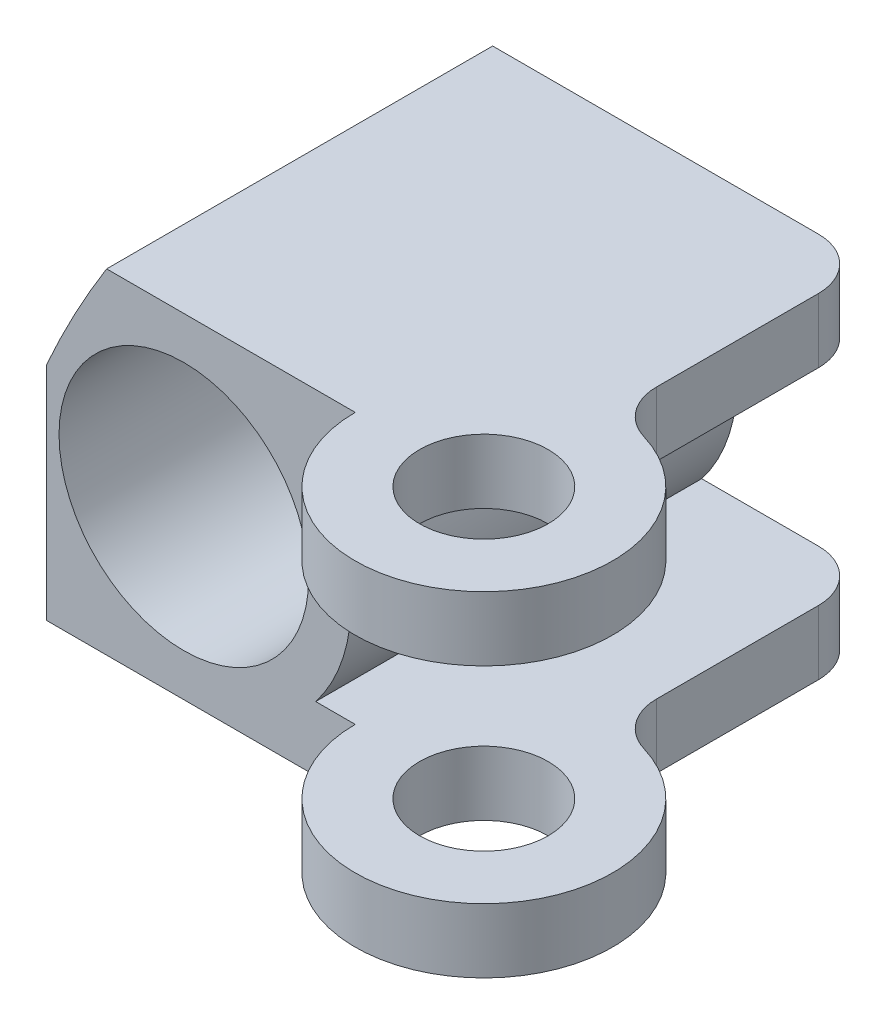
ISO-10303-21;
HEADER;
FILE_DESCRIPTION(('STEP AP214'),'2;1');
FILE_NAME('part.step','',(''),(''),'','','');
FILE_SCHEMA(('AUTOMOTIVE_DESIGN { 1 0 10303 214 1 1 1 1 }'));
ENDSEC;
DATA;
#1=APPLICATION_CONTEXT('core data for automotive mechanical design processes');
#2=APPLICATION_PROTOCOL_DEFINITION('international standard','automotive_design',2000,#1);
#3=PRODUCT_CONTEXT('',#1,'mechanical');
#4=PRODUCT('Part','Part','',(#3));
#5=PRODUCT_RELATED_PRODUCT_CATEGORY('part','',(#4));
#6=PRODUCT_DEFINITION_FORMATION('','',#4);
#7=PRODUCT_DEFINITION_CONTEXT('part definition',#1,'design');
#8=PRODUCT_DEFINITION('design','',#6,#7);
#9=PRODUCT_DEFINITION_SHAPE('','',#8);
#10=(LENGTH_UNIT() NAMED_UNIT(*) SI_UNIT(.MILLI.,.METRE.));
#11=(NAMED_UNIT(*) PLANE_ANGLE_UNIT() SI_UNIT($,.RADIAN.));
#12=(NAMED_UNIT(*) SI_UNIT($,.STERADIAN.) SOLID_ANGLE_UNIT());
#13=UNCERTAINTY_MEASURE_WITH_UNIT(LENGTH_MEASURE(1.E-05),#10,'distance_accuracy_value','');
#14=(GEOMETRIC_REPRESENTATION_CONTEXT(3) GLOBAL_UNCERTAINTY_ASSIGNED_CONTEXT((#13)) GLOBAL_UNIT_ASSIGNED_CONTEXT((#10,
#11,#12)) REPRESENTATION_CONTEXT('',''));
#15=CARTESIAN_POINT('',(0.,0.,0.));
#16=DIRECTION('',(0.,0.,1.));
#17=DIRECTION('',(1.,0.,0.));
#18=AXIS2_PLACEMENT_3D('',#15,#16,#17);
#19=CARTESIAN_POINT('',(-33.8574358250765,15.3458200795581,-25.4));
#20=DIRECTION('',(0.,0.,-1.));
#21=DIRECTION('',(1.,0.,0.));
#22=AXIS2_PLACEMENT_3D('',#19,#20,#21);
#23=PLANE('',#22);
#24=DIRECTION('',(1.,0.,0.));
#25=VECTOR('',#24,1.);
#26=CARTESIAN_POINT('',(-43.8807790564313,7.09082007955806,-25.4));
#27=LINE('',#26,#25);
#28=CARTESIAN_POINT('',(-43.8807790564313,7.09082007955806,-25.4));
#29=VERTEX_POINT('',#28);
#30=CARTESIAN_POINT('',(-21.59,7.09082007955806,-25.4));
#31=VERTEX_POINT('',#30);
#32=EDGE_CURVE('E342',#29,#31,#27,.T.);
#33=ORIENTED_EDGE('',*,*,#32,.F.);
#34=CARTESIAN_POINT('',(0.,0.,-25.4));
#35=DIRECTION('',(0.,0.,1.));
#36=DIRECTION('',(-1.,0.,0.));
#37=AXIS2_PLACEMENT_3D('',#34,#35,#36);
#38=CIRCLE('',#37,44.45);
#39=CARTESIAN_POINT('',(-37.6670119809407,23.6008200795581,-25.4));
#40=VERTEX_POINT('',#39);
#41=EDGE_CURVE('E339',#40,#29,#38,.T.);
#42=ORIENTED_EDGE('',*,*,#41,.F.);
#43=DIRECTION('',(-1.,0.,0.));
#44=VECTOR('',#43,1.);
#45=CARTESIAN_POINT('',(-37.6670119809407,23.6008200795581,-25.4));
#46=LINE('',#45,#44);
#47=CARTESIAN_POINT('',(-21.59,23.6008200795581,-25.4));
#48=VERTEX_POINT('',#47);
#49=EDGE_CURVE('E334',#48,#40,#46,.T.);
#50=ORIENTED_EDGE('',*,*,#49,.F.);
#51=DIRECTION('',(0.,1.,0.));
#52=VECTOR('',#51,1.);
#53=CARTESIAN_POINT('',(-21.59,23.6008200795581,-25.4));
#54=LINE('',#53,#52);
#55=CARTESIAN_POINT('',(-21.59,20.4258200795581,-25.4));
#56=VERTEX_POINT('',#55);
#57=EDGE_CURVE('E306',#56,#48,#54,.T.);
#58=ORIENTED_EDGE('',*,*,#57,.F.);
#59=DIRECTION('',(1.,0.,0.));
#60=VECTOR('',#59,1.);
#61=CARTESIAN_POINT('',(-27.3506220886921,20.4258200795581,-25.4));
#62=LINE('',#61,#60);
#63=CARTESIAN_POINT('',(-27.3506220886921,20.4258200795581,-25.4));
#64=VERTEX_POINT('',#63);
#65=EDGE_CURVE('E331',#64,#56,#62,.T.);
#66=ORIENTED_EDGE('',*,*,#65,.F.);
#67=CARTESIAN_POINT('',(-33.8574358250765,15.3458200795581,-25.4));
#68=DIRECTION('',(0.,0.,1.));
#69=DIRECTION('',(1.,0.,0.));
#70=AXIS2_PLACEMENT_3D('',#67,#68,#69);
#71=CIRCLE('',#70,8.255);
#72=CARTESIAN_POINT('',(-27.3506220886921,10.2658200795581,-25.4));
#73=VERTEX_POINT('',#72);
#74=EDGE_CURVE('E335',#73,#64,#71,.T.);
#75=ORIENTED_EDGE('',*,*,#74,.F.);
#76=DIRECTION('',(-1.,0.,0.));
#77=VECTOR('',#76,1.);
#78=CARTESIAN_POINT('',(-27.3506220886921,10.2658200795581,-25.4));
#79=LINE('',#78,#77);
#80=CARTESIAN_POINT('',(-21.59,10.2658200795581,-25.4));
#81=VERTEX_POINT('',#80);
#82=EDGE_CURVE('E263',#81,#73,#79,.T.);
#83=ORIENTED_EDGE('',*,*,#82,.F.);
#84=DIRECTION('',(0.,1.,0.));
#85=VECTOR('',#84,1.);
#86=CARTESIAN_POINT('',(-21.59,10.2658200795581,-25.4));
#87=LINE('',#86,#85);
#88=EDGE_CURVE('E309',#31,#81,#87,.T.);
#89=ORIENTED_EDGE('',*,*,#88,.F.);
#90=EDGE_LOOP('',(#33,#42,#50,#58,#66,#75,#83,#89));
#91=FACE_BOUND('',#90,.T.);
#92=CARTESIAN_POINT('',(-33.8574358250765,15.3458200795581,-25.4));
#93=DIRECTION('',(0.,0.,1.));
#94=DIRECTION('',(1.,0.,0.));
#95=AXIS2_PLACEMENT_3D('',#92,#93,#94);
#96=CIRCLE('',#95,6.1595);
#97=CARTESIAN_POINT('',(-27.6979358250765,15.3458200795581,-25.4));
#98=VERTEX_POINT('',#97);
#99=EDGE_CURVE('E354',#98,#98,#96,.T.);
#100=ORIENTED_EDGE('',*,*,#99,.T.);
#101=EDGE_LOOP('',(#100));
#102=FACE_BOUND('',#101,.T.);
#103=ADVANCED_FACE('F35',(#91,#102),#23,.T.);
#104=CARTESIAN_POINT('',(-33.8574358250765,15.3458200795581,-25.4));
#105=DIRECTION('',(0.,0.,1.));
#106=DIRECTION('',(-1.,0.,0.));
#107=AXIS2_PLACEMENT_3D('',#104,#105,#106);
#108=CYLINDRICAL_SURFACE('',#107,8.255);
#109=DIRECTION('',(0.,0.,1.));
#110=VECTOR('',#109,1.);
#111=CARTESIAN_POINT('',(-27.3506220886921,10.2658200795581,-25.4));
#112=LINE('',#111,#110);
#113=CARTESIAN_POINT('',(-27.3506220886921,10.2658200795581,-6.35));
#114=VERTEX_POINT('',#113);
#115=EDGE_CURVE('E349',#73,#114,#112,.T.);
#116=ORIENTED_EDGE('',*,*,#115,.F.);
#117=ORIENTED_EDGE('',*,*,#74,.T.);
#118=DIRECTION('',(0.,0.,1.));
#119=VECTOR('',#118,1.);
#120=CARTESIAN_POINT('',(-27.3506220886921,20.4258200795581,-25.4));
#121=LINE('',#120,#119);
#122=CARTESIAN_POINT('',(-27.3506220886921,20.4258200795581,-6.35));
#123=VERTEX_POINT('',#122);
#124=EDGE_CURVE('E276',#64,#123,#121,.T.);
#125=ORIENTED_EDGE('',*,*,#124,.T.);
#126=CARTESIAN_POINT('',(-33.8574358250765,15.3458200795581,-6.35));
#127=DIRECTION('',(0.,0.,1.));
#128=DIRECTION('',(1.,0.,0.));
#129=AXIS2_PLACEMENT_3D('',#126,#127,#128);
#130=CIRCLE('',#129,8.255);
#131=EDGE_CURVE('E184',#114,#123,#130,.T.);
#132=ORIENTED_EDGE('',*,*,#131,.F.);
#133=EDGE_LOOP('',(#116,#117,#125,#132));
#134=FACE_BOUND('',#133,.T.);
#135=ADVANCED_FACE('F222',(#134),#108,.T.);
#136=CARTESIAN_POINT('',(-27.3506220886921,20.4258200795581,-25.4));
#137=DIRECTION('',(0.,1.,0.));
#138=DIRECTION('',(0.,0.,-1.));
#139=AXIS2_PLACEMENT_3D('',#136,#137,#138);
#140=PLANE('',#139);
#141=DIRECTION('',(0.,0.,-1.));
#142=VECTOR('',#141,1.);
#143=CARTESIAN_POINT('',(-19.05,20.4258200795581,-25.4));
#144=LINE('',#143,#142);
#145=CARTESIAN_POINT('',(-19.05,20.4258200795581,-14.8694189942742));
#146=VERTEX_POINT('',#145);
#147=CARTESIAN_POINT('',(-19.05,20.4258200795581,-22.86));
#148=VERTEX_POINT('',#147);
#149=EDGE_CURVE('E194',#146,#148,#144,.T.);
#150=ORIENTED_EDGE('',*,*,#149,.F.);
#151=CARTESIAN_POINT('',(-16.51,20.4258200795581,-14.8694189942742));
#152=DIRECTION('',(0.,-1.,0.));
#153=DIRECTION('',(0.,0.,-1.));
#154=AXIS2_PLACEMENT_3D('',#151,#152,#153);
#155=CIRCLE('',#154,2.54);
#156=CARTESIAN_POINT('',(-17.2357142857143,20.4258200795581,-12.4352992816244));
#157=VERTEX_POINT('',#156);
#158=EDGE_CURVE('E297',#157,#146,#155,.T.);
#159=ORIENTED_EDGE('',*,*,#158,.F.);
#160=CARTESIAN_POINT('',(-19.05,20.4258200795581,-6.35));
#161=DIRECTION('',(0.,-1.,0.));
#162=DIRECTION('',(0.,0.,-1.));
#163=AXIS2_PLACEMENT_3D('',#160,#161,#162);
#164=CIRCLE('',#163,6.35);
#165=CARTESIAN_POINT('',(-25.4,20.4258200795581,-6.35));
#166=VERTEX_POINT('',#165);
#167=EDGE_CURVE('E191',#166,#157,#164,.F.);
#168=ORIENTED_EDGE('',*,*,#167,.F.);
#169=DIRECTION('',(1.,0.,0.));
#170=VECTOR('',#169,1.);
#171=CARTESIAN_POINT('',(-27.3506220886921,20.4258200795581,-6.35));
#172=LINE('',#171,#170);
#173=EDGE_CURVE('E187',#123,#166,#172,.T.);
#174=ORIENTED_EDGE('',*,*,#173,.F.);
#175=ORIENTED_EDGE('',*,*,#124,.F.);
#176=ORIENTED_EDGE('',*,*,#65,.T.);
#177=CARTESIAN_POINT('',(-21.59,20.4258200795581,-22.86));
#178=DIRECTION('',(0.,-1.,0.));
#179=DIRECTION('',(0.,0.,-1.));
#180=AXIS2_PLACEMENT_3D('',#177,#178,#179);
#181=CIRCLE('',#180,2.54);
#182=EDGE_CURVE('E11',#148,#56,#181,.F.);
#183=ORIENTED_EDGE('',*,*,#182,.F.);
#184=EDGE_LOOP('',(#150,#159,#168,#174,#175,#176,#183));
#185=FACE_BOUND('',#184,.T.);
#186=CARTESIAN_POINT('',(-19.05,20.4258200795581,-6.35));
#187=DIRECTION('',(0.,-1.,0.));
#188=DIRECTION('',(0.,0.,-1.));
#189=AXIS2_PLACEMENT_3D('',#186,#187,#188);
#190=CIRCLE('',#189,3.175);
#191=CARTESIAN_POINT('',(-19.05,20.4258200795581,-9.525));
#192=VERTEX_POINT('',#191);
#193=EDGE_CURVE('E272',#192,#192,#190,.T.);
#194=ORIENTED_EDGE('',*,*,#193,.F.);
#195=EDGE_LOOP('',(#194));
#196=FACE_BOUND('',#195,.T.);
#197=ADVANCED_FACE('F218',(#185,#196),#140,.F.);
#198=CARTESIAN_POINT('',(-37.6670119809407,23.6008200795581,-25.4));
#199=DIRECTION('',(0.,-1.,0.));
#200=DIRECTION('',(0.,0.,1.));
#201=AXIS2_PLACEMENT_3D('',#198,#199,#200);
#202=PLANE('',#201);
#203=ORIENTED_EDGE('',*,*,#49,.T.);
#204=DIRECTION('',(0.,0.,1.));
#205=VECTOR('',#204,1.);
#206=CARTESIAN_POINT('',(-37.6670119809407,23.6008200795581,-25.4));
#207=LINE('',#206,#205);
#208=CARTESIAN_POINT('',(-37.6670119809407,23.6008200795581,-6.35));
#209=VERTEX_POINT('',#208);
#210=EDGE_CURVE('E352',#40,#209,#207,.T.);
#211=ORIENTED_EDGE('',*,*,#210,.T.);
#212=DIRECTION('',(1.,0.,0.));
#213=VECTOR('',#212,1.);
#214=CARTESIAN_POINT('',(-40.64,23.6008200795581,-6.35));
#215=LINE('',#214,#213);
#216=CARTESIAN_POINT('',(-25.4,23.6008200795581,-6.35));
#217=VERTEX_POINT('',#216);
#218=EDGE_CURVE('E171',#209,#217,#215,.T.);
#219=ORIENTED_EDGE('',*,*,#218,.T.);
#220=CARTESIAN_POINT('',(-19.05,23.6008200795581,-6.35));
#221=DIRECTION('',(0.,1.,0.));
#222=DIRECTION('',(0.,0.,-1.));
#223=AXIS2_PLACEMENT_3D('',#220,#221,#222);
#224=CIRCLE('',#223,6.35);
#225=CARTESIAN_POINT('',(-17.2357142857143,23.6008200795581,-12.4352992816244));
#226=VERTEX_POINT('',#225);
#227=EDGE_CURVE('E174',#217,#226,#224,.T.);
#228=ORIENTED_EDGE('',*,*,#227,.T.);
#229=CARTESIAN_POINT('',(-16.51,23.6008200795581,-14.8694189942742));
#230=DIRECTION('',(0.,1.,0.));
#231=DIRECTION('',(0.,0.,1.));
#232=AXIS2_PLACEMENT_3D('',#229,#230,#231);
#233=CIRCLE('',#232,2.54);
#234=CARTESIAN_POINT('',(-19.05,23.6008200795581,-14.8694189942742));
#235=VERTEX_POINT('',#234);
#236=EDGE_CURVE('E294',#235,#226,#233,.T.);
#237=ORIENTED_EDGE('',*,*,#236,.F.);
#238=DIRECTION('',(0.,0.,-1.));
#239=VECTOR('',#238,1.);
#240=CARTESIAN_POINT('',(-19.05,23.6008200795581,-12.7));
#241=LINE('',#240,#239);
#242=CARTESIAN_POINT('',(-19.05,23.6008200795581,-22.86));
#243=VERTEX_POINT('',#242);
#244=EDGE_CURVE('E158',#235,#243,#241,.T.);
#245=ORIENTED_EDGE('',*,*,#244,.T.);
#246=CARTESIAN_POINT('',(-21.59,23.6008200795581,-22.86));
#247=DIRECTION('',(0.,1.,0.));
#248=DIRECTION('',(0.,0.,1.));
#249=AXIS2_PLACEMENT_3D('',#246,#247,#248);
#250=CIRCLE('',#249,2.54);
#251=EDGE_CURVE('E319',#48,#243,#250,.F.);
#252=ORIENTED_EDGE('',*,*,#251,.F.);
#253=EDGE_LOOP('',(#203,#211,#219,#228,#237,#245,#252));
#254=FACE_BOUND('',#253,.T.);
#255=CARTESIAN_POINT('',(-19.05,23.6008200795581,-6.35));
#256=DIRECTION('',(0.,-1.,0.));
#257=DIRECTION('',(0.,0.,-1.));
#258=AXIS2_PLACEMENT_3D('',#255,#256,#257);
#259=CIRCLE('',#258,3.175);
#260=CARTESIAN_POINT('',(-19.05,23.6008200795581,-9.525));
#261=VERTEX_POINT('',#260);
#262=EDGE_CURVE('E203',#261,#261,#259,.T.);
#263=ORIENTED_EDGE('',*,*,#262,.T.);
#264=EDGE_LOOP('',(#263));
#265=FACE_BOUND('',#264,.T.);
#266=ADVANCED_FACE('F213',(#254,#265),#202,.F.);
#267=CARTESIAN_POINT('',(0.,0.,-25.4));
#268=DIRECTION('',(0.,0.,1.));
#269=DIRECTION('',(-1.,0.,0.));
#270=AXIS2_PLACEMENT_3D('',#267,#268,#269);
#271=CYLINDRICAL_SURFACE('',#270,44.45);
#272=CARTESIAN_POINT('',(0.,0.,-6.35));
#273=DIRECTION('',(0.,0.,1.));
#274=DIRECTION('',(1.,0.,0.));
#275=AXIS2_PLACEMENT_3D('',#272,#273,#274);
#276=CIRCLE('',#275,44.45);
#277=CARTESIAN_POINT('',(-40.64,18.0053575360224,-6.35));
#278=VERTEX_POINT('',#277);
#279=EDGE_CURVE('E146',#209,#278,#276,.T.);
#280=ORIENTED_EDGE('',*,*,#279,.F.);
#281=ORIENTED_EDGE('',*,*,#210,.F.);
#282=ORIENTED_EDGE('',*,*,#41,.T.);
#283=DIRECTION('',(0.,0.,1.));
#284=VECTOR('',#283,1.);
#285=CARTESIAN_POINT('',(-43.8807790564313,7.09082007955806,-25.4));
#286=LINE('',#285,#284);
#287=CARTESIAN_POINT('',(-43.8807790564313,7.09082007955806,-11.8867179017965));
#288=VERTEX_POINT('',#287);
#289=EDGE_CURVE('E351',#29,#288,#286,.T.);
#290=ORIENTED_EDGE('',*,*,#289,.T.);
#291=CARTESIAN_POINT('',(-40.64,18.0053575360224,-6.35));
#292=CARTESIAN_POINT('',(-40.6399858684762,18.0053850674031,-6.42860205927988));
#293=CARTESIAN_POINT('',(-40.6414589667043,18.0020644090249,-6.50718713842052));
#294=CARTESIAN_POINT('',(-40.6472714524176,17.9889387291809,-6.6636382192536));
#295=CARTESIAN_POINT('',(-40.6516082538039,17.979139558198,-6.74150480551763));
#296=CARTESIAN_POINT('',(-40.6629877454723,17.953387179122,-6.89526719531025));
#297=CARTESIAN_POINT('',(-40.670005174567,17.9374914174421,-6.97117453940111));
#298=CARTESIAN_POINT('',(-40.6865585221489,17.8999128340143,-7.12125351985808));
#299=CARTESIAN_POINT('',(-40.6960948907276,17.8782289780255,-7.19542484344604));
#300=CARTESIAN_POINT('',(-40.7280809302924,17.8053006165963,-7.41418329624837));
#301=CARTESIAN_POINT('',(-40.7539593059729,17.7460632897751,-7.55567326486585));
#302=CARTESIAN_POINT('',(-40.8129268155589,17.6100265474026,-7.82846613663836));
#303=CARTESIAN_POINT('',(-40.8460337895425,17.5331836580071,-7.95974272639628));
#304=CARTESIAN_POINT('',(-40.9432545484435,17.3053912774347,-8.30191851672014));
#305=CARTESIAN_POINT('',(-41.0125677515992,17.1408389041428,-8.50233665325664));
#306=CARTESIAN_POINT('',(-41.1227473901252,16.8739931244987,-8.78060266897358));
#307=CARTESIAN_POINT('',(-41.160581652018,16.7815262143035,-8.86976949615618));
#308=CARTESIAN_POINT('',(-41.2377412537271,16.5910131308004,-9.0412530228011));
#309=CARTESIAN_POINT('',(-41.2770662713191,16.492968160912,-9.1235711904387));
#310=CARTESIAN_POINT('',(-41.3892881018672,16.2101141877237,-9.34676355510312));
#311=CARTESIAN_POINT('',(-41.4632986423793,16.0200194827513,-9.48036971614077));
#312=CARTESIAN_POINT('',(-41.612304225724,15.6289016411106,-9.72993927328907));
#313=CARTESIAN_POINT('',(-41.687300072299,15.4278691004059,-9.84588715128312));
#314=CARTESIAN_POINT('',(-41.8369591075026,15.0172968330521,-10.0629604635134));
#315=CARTESIAN_POINT('',(-41.9116212420885,14.8077398368429,-10.1640536771114));
#316=CARTESIAN_POINT('',(-42.0594463948925,14.3824948297918,-10.3533162747553));
#317=CARTESIAN_POINT('',(-42.1326098434426,14.1668086225886,-10.4414894147122));
#318=CARTESIAN_POINT('',(-42.2840664126217,13.7085444117589,-10.6151224590177));
#319=CARTESIAN_POINT('',(-42.3621317889708,13.4654496892092,-10.6994099343058));
#320=CARTESIAN_POINT('',(-42.5150453128146,12.9745731407807,-10.8565832502906));
#321=CARTESIAN_POINT('',(-42.5898926791861,12.7267901976925,-10.9294663339493));
#322=CARTESIAN_POINT('',(-42.7359817981814,12.2272704887145,-11.0654845232775));
#323=CARTESIAN_POINT('',(-42.8072201931958,11.9755303164475,-11.1286106595937));
#324=CARTESIAN_POINT('',(-42.9457122756752,11.4689695287864,-11.2463756369765));
#325=CARTESIAN_POINT('',(-43.012965494977,11.2141485556887,-11.3010134820888));
#326=CARTESIAN_POINT('',(-43.1432601708625,10.7019363824853,-11.4029135052793));
#327=CARTESIAN_POINT('',(-43.2063010465743,10.4445448335055,-11.4501746673263));
#328=CARTESIAN_POINT('',(-43.3279970552494,9.92762373124177,-11.5382422780082));
#329=CARTESIAN_POINT('',(-43.3866518278721,9.66809400423591,-11.5790481966186));
#330=CARTESIAN_POINT('',(-43.5557643325157,8.88714520807768,-11.6929499554332));
#331=CARTESIAN_POINT('',(-43.6594672686087,8.3629857111762,-11.7576028532993));
#332=CARTESIAN_POINT('',(-43.7760131513114,7.71226899882168,-11.8266259838594));
#333=CARTESIAN_POINT('',(-43.7977140320062,7.5880611330193,-11.8392985217988));
#334=CARTESIAN_POINT('',(-43.8400424608099,7.33955210516721,-11.8636986749844));
#335=CARTESIAN_POINT('',(-43.8606714812607,7.21525132251778,-11.8754275992517));
#336=CARTESIAN_POINT('',(-43.8807790564313,7.09082007955806,-11.8867179017965));
#337=B_SPLINE_CURVE_WITH_KNOTS('',3,(#291,#292,#293,#294,#295,#296,#297,#298,#299,#300,#301,
#302,#303,#304,#305,#306,#307,#308,#309,#310,#311,#312,#313,#314,#315,#316,#317,#318,#319,#320,
#321,#322,#323,#324,#325,#326,#327,#328,#329,#330,#331,#332,#333,#334,#335,#336),.UNSPECIFIED.,
.F.,.F.,(4,2,2,2,2,2,2,2,2,2,2,2,2,2,2,2,2,2,2,2,2,2,4),(0.,0.235694740019568,0.471176923855376,
0.704492676434341,0.937850146784164,1.4025774760099,1.86846497782513,2.66874785915352,
3.07031815307747,3.47180213771034,4.20215206583604,4.93314016787749,5.66569113444536,
6.39802872157083,7.20429450491854,8.01075490473667,8.81795231266198,9.62524435983153,
10.4326475018449,11.2401169034104,12.8538582290616,13.2340305774573,13.6136660991286),.UNSPECIFIED.);
#338=EDGE_CURVE('E155',#278,#288,#337,.T.);
#339=ORIENTED_EDGE('',*,*,#338,.F.);
#340=EDGE_LOOP('',(#280,#281,#282,#290,#339));
#341=FACE_BOUND('',#340,.T.);
#342=ADVANCED_FACE('F208',(#341),#271,.T.);
#343=CARTESIAN_POINT('',(-43.8807790564313,7.09082007955806,-25.4));
#344=DIRECTION('',(0.,1.,0.));
#345=DIRECTION('',(0.,0.,-1.));
#346=AXIS2_PLACEMENT_3D('',#343,#344,#345);
#347=PLANE('',#346);
#348=DIRECTION('',(0.,0.,-1.));
#349=VECTOR('',#348,1.);
#350=CARTESIAN_POINT('',(-19.05,7.09082007955806,-12.7));
#351=LINE('',#350,#349);
#352=CARTESIAN_POINT('',(-19.05,7.09082007955806,-14.8694189942742));
#353=VERTEX_POINT('',#352);
#354=CARTESIAN_POINT('',(-19.05,7.09082007955806,-22.86));
#355=VERTEX_POINT('',#354);
#356=EDGE_CURVE('E151',#353,#355,#351,.T.);
#357=ORIENTED_EDGE('',*,*,#356,.F.);
#358=CARTESIAN_POINT('',(-16.51,7.09082007955806,-14.8694189942742));
#359=DIRECTION('',(0.,-1.,0.));
#360=DIRECTION('',(0.,0.,-1.));
#361=AXIS2_PLACEMENT_3D('',#358,#359,#360);
#362=CIRCLE('',#361,2.54);
#363=CARTESIAN_POINT('',(-17.2357142857143,7.09082007955806,-12.4352992816244));
#364=VERTEX_POINT('',#363);
#365=EDGE_CURVE('E303',#364,#353,#362,.T.);
#366=ORIENTED_EDGE('',*,*,#365,.F.);
#367=CARTESIAN_POINT('',(-19.05,7.09082007955806,-6.35));
#368=DIRECTION('',(0.,1.,0.));
#369=DIRECTION('',(0.,0.,-1.));
#370=AXIS2_PLACEMENT_3D('',#367,#368,#369);
#371=CIRCLE('',#370,6.35);
#372=CARTESIAN_POINT('',(-25.4,7.09082007955806,-6.35));
#373=VERTEX_POINT('',#372);
#374=EDGE_CURVE('E165',#373,#364,#371,.T.);
#375=ORIENTED_EDGE('',*,*,#374,.F.);
#376=DIRECTION('',(1.,0.,0.));
#377=VECTOR('',#376,1.);
#378=CARTESIAN_POINT('',(-40.64,7.09082007955806,-6.35));
#379=LINE('',#378,#377);
#380=CARTESIAN_POINT('',(-40.64,7.09082007955806,-6.35));
#381=VERTEX_POINT('',#380);
#382=EDGE_CURVE('E144',#381,#373,#379,.T.);
#383=ORIENTED_EDGE('',*,*,#382,.F.);
#384=CARTESIAN_POINT('',(-46.99,7.09082007955806,-6.35));
#385=DIRECTION('',(0.,-1.,0.));
#386=DIRECTION('',(0.,0.,-1.));
#387=AXIS2_PLACEMENT_3D('',#384,#385,#386);
#388=CIRCLE('',#387,6.35);
#389=EDGE_CURVE('E153',#288,#381,#388,.T.);
#390=ORIENTED_EDGE('',*,*,#389,.F.);
#391=ORIENTED_EDGE('',*,*,#289,.F.);
#392=ORIENTED_EDGE('',*,*,#32,.T.);
#393=CARTESIAN_POINT('',(-21.59,7.09082007955806,-22.86));
#394=DIRECTION('',(0.,-1.,0.));
#395=DIRECTION('',(0.,0.,-1.));
#396=AXIS2_PLACEMENT_3D('',#393,#394,#395);
#397=CIRCLE('',#396,2.54);
#398=EDGE_CURVE('E317',#355,#31,#397,.F.);
#399=ORIENTED_EDGE('',*,*,#398,.F.);
#400=EDGE_LOOP('',(#357,#366,#375,#383,#390,#391,#392,#399));
#401=FACE_BOUND('',#400,.T.);
#402=CARTESIAN_POINT('',(-19.05,7.09082007955806,-6.35));
#403=DIRECTION('',(0.,-1.,0.));
#404=DIRECTION('',(0.,0.,-1.));
#405=AXIS2_PLACEMENT_3D('',#402,#403,#404);
#406=CIRCLE('',#405,3.175);
#407=CARTESIAN_POINT('',(-19.05,7.09082007955806,-9.525));
#408=VERTEX_POINT('',#407);
#409=EDGE_CURVE('E269',#408,#408,#406,.T.);
#410=ORIENTED_EDGE('',*,*,#409,.F.);
#411=EDGE_LOOP('',(#410));
#412=FACE_BOUND('',#411,.T.);
#413=ADVANCED_FACE('F161',(#401,#412),#347,.F.);
#414=CARTESIAN_POINT('',(-27.3506220886921,10.2658200795581,-25.4));
#415=DIRECTION('',(0.,-1.,0.));
#416=DIRECTION('',(0.,0.,1.));
#417=AXIS2_PLACEMENT_3D('',#414,#415,#416);
#418=PLANE('',#417);
#419=ORIENTED_EDGE('',*,*,#82,.T.);
#420=ORIENTED_EDGE('',*,*,#115,.T.);
#421=DIRECTION('',(-1.,0.,0.));
#422=VECTOR('',#421,1.);
#423=CARTESIAN_POINT('',(-27.3506220886921,10.2658200795581,-6.35));
#424=LINE('',#423,#422);
#425=CARTESIAN_POINT('',(-25.4,10.2658200795581,-6.35));
#426=VERTEX_POINT('',#425);
#427=EDGE_CURVE('E182',#426,#114,#424,.T.);
#428=ORIENTED_EDGE('',*,*,#427,.F.);
#429=CARTESIAN_POINT('',(-19.05,10.2658200795581,-6.35));
#430=DIRECTION('',(0.,1.,0.));
#431=DIRECTION('',(0.,0.,1.));
#432=AXIS2_PLACEMENT_3D('',#429,#430,#431);
#433=CIRCLE('',#432,6.35);
#434=CARTESIAN_POINT('',(-17.2357142857143,10.2658200795581,-12.4352992816244));
#435=VERTEX_POINT('',#434);
#436=EDGE_CURVE('E280',#435,#426,#433,.F.);
#437=ORIENTED_EDGE('',*,*,#436,.F.);
#438=CARTESIAN_POINT('',(-16.51,10.2658200795581,-14.8694189942742));
#439=DIRECTION('',(0.,1.,0.));
#440=DIRECTION('',(0.,0.,1.));
#441=AXIS2_PLACEMENT_3D('',#438,#439,#440);
#442=CIRCLE('',#441,2.54);
#443=CARTESIAN_POINT('',(-19.05,10.2658200795581,-14.8694189942742));
#444=VERTEX_POINT('',#443);
#445=EDGE_CURVE('E300',#444,#435,#442,.T.);
#446=ORIENTED_EDGE('',*,*,#445,.F.);
#447=DIRECTION('',(0.,0.,1.));
#448=VECTOR('',#447,1.);
#449=CARTESIAN_POINT('',(-19.05,10.2658200795581,-25.4));
#450=LINE('',#449,#448);
#451=CARTESIAN_POINT('',(-19.05,10.2658200795581,-22.86));
#452=VERTEX_POINT('',#451);
#453=EDGE_CURVE('E283',#452,#444,#450,.T.);
#454=ORIENTED_EDGE('',*,*,#453,.F.);
#455=CARTESIAN_POINT('',(-21.59,10.2658200795581,-22.86));
#456=DIRECTION('',(0.,1.,0.));
#457=DIRECTION('',(0.,0.,1.));
#458=AXIS2_PLACEMENT_3D('',#455,#456,#457);
#459=CIRCLE('',#458,2.54);
#460=EDGE_CURVE('E312',#81,#452,#459,.F.);
#461=ORIENTED_EDGE('',*,*,#460,.F.);
#462=EDGE_LOOP('',(#419,#420,#428,#437,#446,#454,#461));
#463=FACE_BOUND('',#462,.T.);
#464=CARTESIAN_POINT('',(-19.05,10.2658200795581,-6.35));
#465=DIRECTION('',(0.,1.,0.));
#466=DIRECTION('',(0.,0.,1.));
#467=AXIS2_PLACEMENT_3D('',#464,#465,#466);
#468=CIRCLE('',#467,3.175);
#469=CARTESIAN_POINT('',(-19.05,10.2658200795581,-3.175));
#470=VERTEX_POINT('',#469);
#471=EDGE_CURVE('E267',#470,#470,#468,.T.);
#472=ORIENTED_EDGE('',*,*,#471,.F.);
#473=EDGE_LOOP('',(#472));
#474=FACE_BOUND('',#473,.T.);
#475=ADVANCED_FACE('F250',(#463,#474),#418,.F.);
#476=CARTESIAN_POINT('',(-33.8574358250765,15.3458200795581,-25.4));
#477=DIRECTION('',(0.,0.,1.));
#478=DIRECTION('',(-1.,0.,0.));
#479=AXIS2_PLACEMENT_3D('',#476,#477,#478);
#480=CYLINDRICAL_SURFACE('',#479,6.1595);
#481=CARTESIAN_POINT('',(-33.8574358250765,15.3458200795581,-6.35));
#482=DIRECTION('',(0.,0.,1.));
#483=DIRECTION('',(1.,0.,0.));
#484=AXIS2_PLACEMENT_3D('',#481,#482,#483);
#485=CIRCLE('',#484,6.1595);
#486=CARTESIAN_POINT('',(-27.6979358250765,15.3458200795581,-6.35));
#487=VERTEX_POINT('',#486);
#488=EDGE_CURVE('E180',#487,#487,#485,.T.);
#489=ORIENTED_EDGE('',*,*,#488,.T.);
#490=EDGE_LOOP('',(#489));
#491=FACE_BOUND('',#490,.T.);
#492=ORIENTED_EDGE('',*,*,#99,.F.);
#493=EDGE_LOOP('',(#492));
#494=FACE_BOUND('',#493,.T.);
#495=ADVANCED_FACE('F249',(#491,#494),#480,.F.);
#496=CARTESIAN_POINT('',(-19.05,-1.79917992044194,-6.35));
#497=DIRECTION('',(0.,1.,0.));
#498=DIRECTION('',(0.,0.,-1.));
#499=AXIS2_PLACEMENT_3D('',#496,#497,#498);
#500=CYLINDRICAL_SURFACE('',#499,3.175);
#501=ORIENTED_EDGE('',*,*,#471,.T.);
#502=EDGE_LOOP('',(#501));
#503=FACE_BOUND('',#502,.T.);
#504=ORIENTED_EDGE('',*,*,#409,.T.);
#505=EDGE_LOOP('',(#504));
#506=FACE_BOUND('',#505,.T.);
#507=ADVANCED_FACE('F257',(#503,#506),#500,.F.);
#508=ORIENTED_EDGE('',*,*,#262,.F.);
#509=EDGE_LOOP('',(#508));
#510=FACE_BOUND('',#509,.T.);
#511=ORIENTED_EDGE('',*,*,#193,.T.);
#512=EDGE_LOOP('',(#511));
#513=FACE_BOUND('',#512,.T.);
#514=ADVANCED_FACE('F361',(#510,#513),#500,.F.);
#515=CARTESIAN_POINT('',(-40.64,7.09082007955806,-6.35));
#516=DIRECTION('',(0.,0.,-1.));
#517=DIRECTION('',(1.,0.,0.));
#518=AXIS2_PLACEMENT_3D('',#515,#516,#517);
#519=PLANE('',#518);
#520=ORIENTED_EDGE('',*,*,#488,.F.);
#521=EDGE_LOOP('',(#520));
#522=FACE_BOUND('',#521,.T.);
#523=ORIENTED_EDGE('',*,*,#218,.F.);
#524=ORIENTED_EDGE('',*,*,#279,.T.);
#525=DIRECTION('',(0.,1.,0.));
#526=VECTOR('',#525,1.);
#527=CARTESIAN_POINT('',(-40.64,7.09082007955806,-6.35));
#528=LINE('',#527,#526);
#529=EDGE_CURVE('E139',#381,#278,#528,.T.);
#530=ORIENTED_EDGE('',*,*,#529,.F.);
#531=ORIENTED_EDGE('',*,*,#382,.T.);
#532=DIRECTION('',(0.,1.,0.));
#533=VECTOR('',#532,1.);
#534=CARTESIAN_POINT('',(-25.4,7.09082007955806,-6.35));
#535=LINE('',#534,#533);
#536=EDGE_CURVE('E179',#373,#426,#535,.T.);
#537=ORIENTED_EDGE('',*,*,#536,.T.);
#538=ORIENTED_EDGE('',*,*,#427,.T.);
#539=ORIENTED_EDGE('',*,*,#131,.T.);
#540=ORIENTED_EDGE('',*,*,#173,.T.);
#541=EDGE_CURVE('E150',#166,#217,#535,.T.);
#542=ORIENTED_EDGE('',*,*,#541,.T.);
#543=EDGE_LOOP('',(#523,#524,#530,#531,#537,#538,#539,#540,#542));
#544=FACE_BOUND('',#543,.T.);
#545=ADVANCED_FACE('F142',(#522,#544),#519,.F.);
#546=CARTESIAN_POINT('',(-19.05,7.09082007955806,-6.35));
#547=DIRECTION('',(0.,1.,0.));
#548=DIRECTION('',(0.,0.,-1.));
#549=AXIS2_PLACEMENT_3D('',#546,#547,#548);
#550=CYLINDRICAL_SURFACE('',#549,6.35);
#551=ORIENTED_EDGE('',*,*,#436,.T.);
#552=ORIENTED_EDGE('',*,*,#536,.F.);
#553=ORIENTED_EDGE('',*,*,#374,.T.);
#554=DIRECTION('',(0.,1.,0.));
#555=VECTOR('',#554,1.);
#556=CARTESIAN_POINT('',(-17.2357142857143,7.09082007955806,-12.4352992816244));
#557=LINE('',#556,#555);
#558=EDGE_CURVE('E292',#435,#364,#557,.F.);
#559=ORIENTED_EDGE('',*,*,#558,.F.);
#560=EDGE_LOOP('',(#551,#552,#553,#559));
#561=FACE_BOUND('',#560,.T.);
#562=ADVANCED_FACE('F368',(#561),#550,.T.);
#563=CARTESIAN_POINT('',(-46.99,7.09082007955806,-6.35));
#564=DIRECTION('',(0.,1.,0.));
#565=DIRECTION('',(0.,0.,-1.));
#566=AXIS2_PLACEMENT_3D('',#563,#564,#565);
#567=CYLINDRICAL_SURFACE('',#566,6.35);
#568=ORIENTED_EDGE('',*,*,#529,.T.);
#569=ORIENTED_EDGE('',*,*,#338,.T.);
#570=ORIENTED_EDGE('',*,*,#389,.T.);
#571=EDGE_LOOP('',(#568,#569,#570));
#572=FACE_BOUND('',#571,.T.);
#573=ADVANCED_FACE('F154',(#572),#567,.F.);
#574=ORIENTED_EDGE('',*,*,#227,.F.);
#575=ORIENTED_EDGE('',*,*,#541,.F.);
#576=ORIENTED_EDGE('',*,*,#167,.T.);
#577=DIRECTION('',(0.,1.,0.));
#578=VECTOR('',#577,1.);
#579=CARTESIAN_POINT('',(-17.2357142857143,7.09082007955806,-12.4352992816244));
#580=LINE('',#579,#578);
#581=EDGE_CURVE('E288',#226,#157,#580,.F.);
#582=ORIENTED_EDGE('',*,*,#581,.F.);
#583=EDGE_LOOP('',(#574,#575,#576,#582));
#584=FACE_BOUND('',#583,.T.);
#585=ADVANCED_FACE('F451',(#584),#550,.T.);
#586=CARTESIAN_POINT('',(-19.05,7.09082007955806,-12.7));
#587=DIRECTION('',(-1.,0.,0.));
#588=DIRECTION('',(0.,0.,-1.));
#589=AXIS2_PLACEMENT_3D('',#586,#587,#588);
#590=PLANE('',#589);
#591=ORIENTED_EDGE('',*,*,#453,.T.);
#592=DIRECTION('',(0.,-1.,0.));
#593=VECTOR('',#592,1.);
#594=CARTESIAN_POINT('',(-19.05,10.2658200795581,-14.8694189942742));
#595=LINE('',#594,#593);
#596=EDGE_CURVE('E290',#353,#444,#595,.F.);
#597=ORIENTED_EDGE('',*,*,#596,.F.);
#598=ORIENTED_EDGE('',*,*,#356,.T.);
#599=DIRECTION('',(0.,1.,0.));
#600=VECTOR('',#599,1.);
#601=CARTESIAN_POINT('',(-19.05,7.09082007955806,-22.86));
#602=LINE('',#601,#600);
#603=EDGE_CURVE('E315',#452,#355,#602,.F.);
#604=ORIENTED_EDGE('',*,*,#603,.F.);
#605=EDGE_LOOP('',(#591,#597,#598,#604));
#606=FACE_BOUND('',#605,.T.);
#607=ADVANCED_FACE('F472',(#606),#590,.F.);
#608=ORIENTED_EDGE('',*,*,#244,.F.);
#609=DIRECTION('',(0.,-1.,0.));
#610=VECTOR('',#609,1.);
#611=CARTESIAN_POINT('',(-19.05,23.6008200795581,-14.8694189942742));
#612=LINE('',#611,#610);
#613=EDGE_CURVE('E286',#146,#235,#612,.F.);
#614=ORIENTED_EDGE('',*,*,#613,.F.);
#615=ORIENTED_EDGE('',*,*,#149,.T.);
#616=DIRECTION('',(0.,1.,0.));
#617=VECTOR('',#616,1.);
#618=CARTESIAN_POINT('',(-19.05,20.4258200795581,-22.86));
#619=LINE('',#618,#617);
#620=EDGE_CURVE('E43',#243,#148,#619,.F.);
#621=ORIENTED_EDGE('',*,*,#620,.F.);
#622=EDGE_LOOP('',(#608,#614,#615,#621));
#623=FACE_BOUND('',#622,.T.);
#624=ADVANCED_FACE('F231',(#623),#590,.F.);
#625=CARTESIAN_POINT('',(-16.51,7.09082007955806,-14.8694189942742));
#626=DIRECTION('',(0.,1.,0.));
#627=DIRECTION('',(0.,0.,-1.));
#628=AXIS2_PLACEMENT_3D('',#625,#626,#627);
#629=CYLINDRICAL_SURFACE('',#628,2.54);
#630=ORIENTED_EDGE('',*,*,#158,.T.);
#631=ORIENTED_EDGE('',*,*,#613,.T.);
#632=ORIENTED_EDGE('',*,*,#236,.T.);
#633=ORIENTED_EDGE('',*,*,#581,.T.);
#634=EDGE_LOOP('',(#630,#631,#632,#633));
#635=FACE_BOUND('',#634,.T.);
#636=ADVANCED_FACE('F227',(#635),#629,.F.);
#637=CARTESIAN_POINT('',(-16.51,7.09082007955806,-14.8694189942742));
#638=DIRECTION('',(0.,1.,0.));
#639=DIRECTION('',(0.,0.,-1.));
#640=AXIS2_PLACEMENT_3D('',#637,#638,#639);
#641=CYLINDRICAL_SURFACE('',#640,2.54);
#642=ORIENTED_EDGE('',*,*,#365,.T.);
#643=ORIENTED_EDGE('',*,*,#596,.T.);
#644=ORIENTED_EDGE('',*,*,#445,.T.);
#645=ORIENTED_EDGE('',*,*,#558,.T.);
#646=EDGE_LOOP('',(#642,#643,#644,#645));
#647=FACE_BOUND('',#646,.T.);
#648=ADVANCED_FACE('F230',(#647),#641,.F.);
#649=CARTESIAN_POINT('',(-21.59,15.3458200795581,-22.86));
#650=DIRECTION('',(0.,-1.,0.));
#651=DIRECTION('',(0.,0.,1.));
#652=AXIS2_PLACEMENT_3D('',#649,#650,#651);
#653=CYLINDRICAL_SURFACE('',#652,2.54);
#654=ORIENTED_EDGE('',*,*,#398,.T.);
#655=ORIENTED_EDGE('',*,*,#88,.T.);
#656=ORIENTED_EDGE('',*,*,#460,.T.);
#657=ORIENTED_EDGE('',*,*,#603,.T.);
#658=EDGE_LOOP('',(#654,#655,#656,#657));
#659=FACE_BOUND('',#658,.T.);
#660=ADVANCED_FACE('F234',(#659),#653,.T.);
#661=CARTESIAN_POINT('',(-21.59,15.3458200795581,-22.86));
#662=DIRECTION('',(0.,-1.,0.));
#663=DIRECTION('',(0.,0.,1.));
#664=AXIS2_PLACEMENT_3D('',#661,#662,#663);
#665=CYLINDRICAL_SURFACE('',#664,2.54);
#666=ORIENTED_EDGE('',*,*,#182,.T.);
#667=ORIENTED_EDGE('',*,*,#57,.T.);
#668=ORIENTED_EDGE('',*,*,#251,.T.);
#669=ORIENTED_EDGE('',*,*,#620,.T.);
#670=EDGE_LOOP('',(#666,#667,#668,#669));
#671=FACE_BOUND('',#670,.T.);
#672=ADVANCED_FACE('F37',(#671),#665,.T.);
#673=CLOSED_SHELL('',(#103,#135,#197,#266,#342,#413,#475,#495,#507,#514,#545,#562,#573,#585,
#607,#624,#636,#648,#660,#672));
#674=MANIFOLD_SOLID_BREP('B2',#673);
#675=ADVANCED_BREP_SHAPE_REPRESENTATION('',(#18,#674),#14);
#676=SHAPE_DEFINITION_REPRESENTATION(#9,#675);
ENDSEC;
END-ISO-10303-21;
